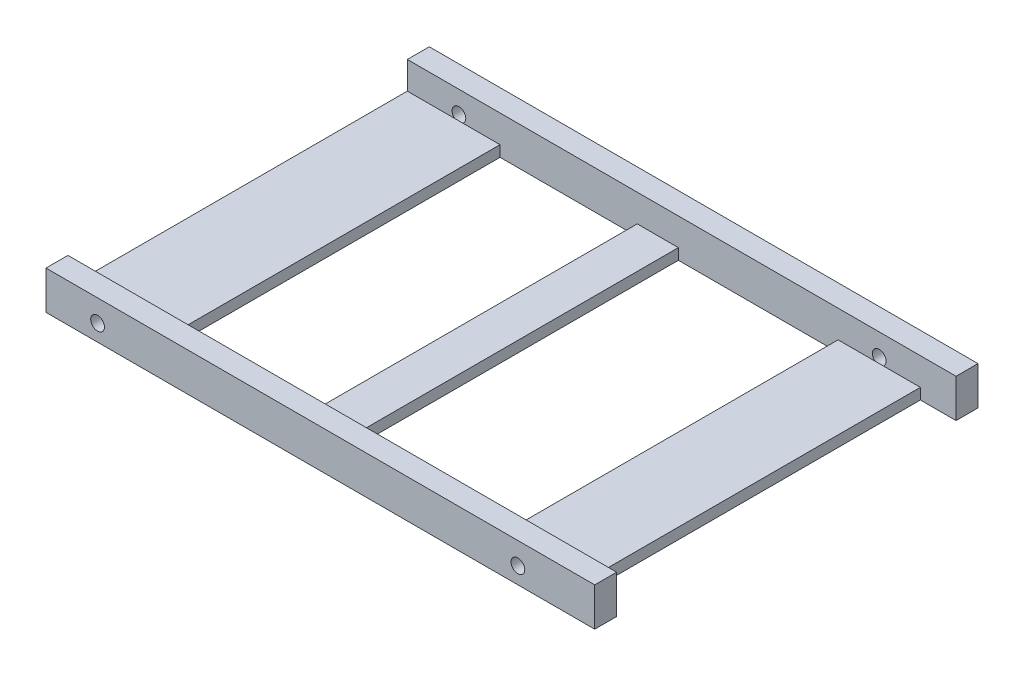
ISO-10303-21;
HEADER;
FILE_DESCRIPTION(('STEP AP214'),'2;1');
FILE_NAME('part.step','',(''),(''),'','','');
FILE_SCHEMA(('AUTOMOTIVE_DESIGN { 1 0 10303 214 1 1 1 1 }'));
ENDSEC;
DATA;
#1=APPLICATION_CONTEXT('core data for automotive mechanical design processes');
#2=APPLICATION_PROTOCOL_DEFINITION('international standard','automotive_design',2000,#1);
#3=PRODUCT_CONTEXT('',#1,'mechanical');
#4=PRODUCT('Part','Part','',(#3));
#5=PRODUCT_RELATED_PRODUCT_CATEGORY('part','',(#4));
#6=PRODUCT_DEFINITION_FORMATION('','',#4);
#7=PRODUCT_DEFINITION_CONTEXT('part definition',#1,'design');
#8=PRODUCT_DEFINITION('design','',#6,#7);
#9=PRODUCT_DEFINITION_SHAPE('','',#8);
#10=(LENGTH_UNIT() NAMED_UNIT(*) SI_UNIT(.MILLI.,.METRE.));
#11=(NAMED_UNIT(*) PLANE_ANGLE_UNIT() SI_UNIT($,.RADIAN.));
#12=(NAMED_UNIT(*) SI_UNIT($,.STERADIAN.) SOLID_ANGLE_UNIT());
#13=UNCERTAINTY_MEASURE_WITH_UNIT(LENGTH_MEASURE(1.E-05),#10,'distance_accuracy_value','');
#14=(GEOMETRIC_REPRESENTATION_CONTEXT(3) GLOBAL_UNCERTAINTY_ASSIGNED_CONTEXT((#13)) GLOBAL_UNIT_ASSIGNED_CONTEXT((#10,
#11,#12)) REPRESENTATION_CONTEXT('',''));
#15=CARTESIAN_POINT('',(0.,0.,0.));
#16=DIRECTION('',(0.,0.,1.));
#17=DIRECTION('',(1.,0.,0.));
#18=AXIS2_PLACEMENT_3D('',#15,#16,#17);
#19=CARTESIAN_POINT('',(0.,7.,0.));
#20=DIRECTION('',(0.,-1.,0.));
#21=DIRECTION('',(0.,0.,-1.));
#22=AXIS2_PLACEMENT_3D('',#19,#20,#21);
#23=PLANE('',#22);
#24=DIRECTION('',(0.,0.,1.));
#25=VECTOR('',#24,1.);
#26=CARTESIAN_POINT('',(0.,7.,0.));
#27=LINE('',#26,#25);
#28=CARTESIAN_POINT('',(0.,7.,-69.85));
#29=VERTEX_POINT('',#28);
#30=CARTESIAN_POINT('',(0.,7.,-65.85));
#31=VERTEX_POINT('',#30);
#32=EDGE_CURVE('E330',#29,#31,#27,.T.);
#33=ORIENTED_EDGE('',*,*,#32,.T.);
#34=DIRECTION('',(-1.,0.,0.));
#35=VECTOR('',#34,1.);
#36=CARTESIAN_POINT('',(16.9,7.,-65.85));
#37=LINE('',#36,#35);
#38=CARTESIAN_POINT('',(100.,7.,-65.85));
#39=VERTEX_POINT('',#38);
#40=EDGE_CURVE('E433',#39,#31,#37,.T.);
#41=ORIENTED_EDGE('',*,*,#40,.F.);
#42=DIRECTION('',(0.,0.,-1.));
#43=VECTOR('',#42,1.);
#44=CARTESIAN_POINT('',(100.,7.,0.));
#45=LINE('',#44,#43);
#46=CARTESIAN_POINT('',(100.,7.,-69.85));
#47=VERTEX_POINT('',#46);
#48=EDGE_CURVE('E338',#39,#47,#45,.T.);
#49=ORIENTED_EDGE('',*,*,#48,.T.);
#50=DIRECTION('',(-1.,0.,0.));
#51=VECTOR('',#50,1.);
#52=CARTESIAN_POINT('',(0.,7.,-69.85));
#53=LINE('',#52,#51);
#54=EDGE_CURVE('E343',#47,#29,#53,.T.);
#55=ORIENTED_EDGE('',*,*,#54,.T.);
#56=EDGE_LOOP('',(#33,#41,#49,#55));
#57=FACE_BOUND('',#56,.T.);
#58=ADVANCED_FACE('F43',(#57),#23,.F.);
#59=CARTESIAN_POINT('',(100.,7.,0.));
#60=DIRECTION('',(-1.,0.,0.));
#61=DIRECTION('',(0.,0.,1.));
#62=AXIS2_PLACEMENT_3D('',#59,#60,#61);
#63=PLANE('',#62);
#64=DIRECTION('',(0.,0.,-1.));
#65=VECTOR('',#64,1.);
#66=CARTESIAN_POINT('',(100.,0.,0.));
#67=LINE('',#66,#65);
#68=CARTESIAN_POINT('',(100.,0.,0.));
#69=VERTEX_POINT('',#68);
#70=CARTESIAN_POINT('',(100.,0.,-4.00000000000001));
#71=VERTEX_POINT('',#70);
#72=EDGE_CURVE('E354',#69,#71,#67,.T.);
#73=ORIENTED_EDGE('',*,*,#72,.T.);
#74=DIRECTION('',(0.,1.,0.));
#75=VECTOR('',#74,1.);
#76=CARTESIAN_POINT('',(100.,0.,-4.00000000000001));
#77=LINE('',#76,#75);
#78=CARTESIAN_POINT('',(100.,7.,-4.00000000000001));
#79=VERTEX_POINT('',#78);
#80=EDGE_CURVE('E300',#71,#79,#77,.T.);
#81=ORIENTED_EDGE('',*,*,#80,.T.);
#82=CARTESIAN_POINT('',(100.,7.,0.));
#83=VERTEX_POINT('',#82);
#84=EDGE_CURVE('E339',#83,#79,#45,.T.);
#85=ORIENTED_EDGE('',*,*,#84,.F.);
#86=DIRECTION('',(0.,-1.,0.));
#87=VECTOR('',#86,1.);
#88=CARTESIAN_POINT('',(100.,7.,0.));
#89=LINE('',#88,#87);
#90=EDGE_CURVE('E52',#83,#69,#89,.T.);
#91=ORIENTED_EDGE('',*,*,#90,.T.);
#92=EDGE_LOOP('',(#73,#81,#85,#91));
#93=FACE_BOUND('',#92,.T.);
#94=ADVANCED_FACE('F373',(#93),#63,.F.);
#95=CARTESIAN_POINT('',(0.,7.,0.));
#96=DIRECTION('',(1.,0.,0.));
#97=DIRECTION('',(0.,0.,-1.));
#98=AXIS2_PLACEMENT_3D('',#95,#96,#97);
#99=PLANE('',#98);
#100=DIRECTION('',(0.,0.,-1.));
#101=VECTOR('',#100,1.);
#102=CARTESIAN_POINT('',(0.,2.,-65.85));
#103=LINE('',#102,#101);
#104=CARTESIAN_POINT('',(0.,1.99999999999999,-3.99999999999998));
#105=VERTEX_POINT('',#104);
#106=CARTESIAN_POINT('',(0.,2.,-65.85));
#107=VERTEX_POINT('',#106);
#108=EDGE_CURVE('E474',#105,#107,#103,.T.);
#109=ORIENTED_EDGE('',*,*,#108,.T.);
#110=DIRECTION('',(0.,1.,0.));
#111=VECTOR('',#110,1.);
#112=CARTESIAN_POINT('',(0.,7.,-65.85));
#113=LINE('',#112,#111);
#114=EDGE_CURVE('E481',#107,#31,#113,.T.);
#115=ORIENTED_EDGE('',*,*,#114,.T.);
#116=ORIENTED_EDGE('',*,*,#32,.F.);
#117=DIRECTION('',(0.,-1.,0.));
#118=VECTOR('',#117,1.);
#119=CARTESIAN_POINT('',(0.,7.,-69.85));
#120=LINE('',#119,#118);
#121=CARTESIAN_POINT('',(0.,0.,-69.85));
#122=VERTEX_POINT('',#121);
#123=EDGE_CURVE('E346',#29,#122,#120,.T.);
#124=ORIENTED_EDGE('',*,*,#123,.T.);
#125=DIRECTION('',(0.,0.,1.));
#126=VECTOR('',#125,1.);
#127=CARTESIAN_POINT('',(0.,0.,0.));
#128=LINE('',#127,#126);
#129=CARTESIAN_POINT('',(0.,0.,0.));
#130=VERTEX_POINT('',#129);
#131=EDGE_CURVE('E315',#122,#130,#128,.T.);
#132=ORIENTED_EDGE('',*,*,#131,.T.);
#133=DIRECTION('',(0.,-1.,0.));
#134=VECTOR('',#133,1.);
#135=CARTESIAN_POINT('',(0.,7.,0.));
#136=LINE('',#135,#134);
#137=CARTESIAN_POINT('',(0.,7.,0.));
#138=VERTEX_POINT('',#137);
#139=EDGE_CURVE('E11',#138,#130,#136,.T.);
#140=ORIENTED_EDGE('',*,*,#139,.F.);
#141=CARTESIAN_POINT('',(0.,7.,-3.99999999999998));
#142=VERTEX_POINT('',#141);
#143=EDGE_CURVE('E335',#142,#138,#27,.T.);
#144=ORIENTED_EDGE('',*,*,#143,.F.);
#145=DIRECTION('',(0.,-1.,0.));
#146=VECTOR('',#145,1.);
#147=CARTESIAN_POINT('',(0.,7.,-3.99999999999998));
#148=LINE('',#147,#146);
#149=EDGE_CURVE('E476',#142,#105,#148,.T.);
#150=ORIENTED_EDGE('',*,*,#149,.T.);
#151=EDGE_LOOP('',(#109,#115,#116,#124,#132,#140,#144,#150));
#152=FACE_BOUND('',#151,.T.);
#153=ADVANCED_FACE('F45',(#152),#99,.F.);
#154=CARTESIAN_POINT('',(0.,7.,0.));
#155=DIRECTION('',(0.,0.,-1.));
#156=DIRECTION('',(-1.,0.,0.));
#157=AXIS2_PLACEMENT_3D('',#154,#155,#156);
#158=PLANE('',#157);
#159=CARTESIAN_POINT('',(9.40000000000001,3.,0.));
#160=DIRECTION('',(0.,0.,1.));
#161=DIRECTION('',(1.,0.,0.));
#162=AXIS2_PLACEMENT_3D('',#159,#160,#161);
#163=CIRCLE('',#162,1.25);
#164=CARTESIAN_POINT('',(10.65,3.,0.));
#165=VERTEX_POINT('',#164);
#166=EDGE_CURVE('E316',#165,#165,#163,.T.);
#167=ORIENTED_EDGE('',*,*,#166,.F.);
#168=EDGE_LOOP('',(#167));
#169=FACE_BOUND('',#168,.T.);
#170=CARTESIAN_POINT('',(86.,3.,0.));
#171=DIRECTION('',(0.,0.,1.));
#172=DIRECTION('',(1.,0.,0.));
#173=AXIS2_PLACEMENT_3D('',#170,#171,#172);
#174=CIRCLE('',#173,1.25);
#175=CARTESIAN_POINT('',(87.25,3.,0.));
#176=VERTEX_POINT('',#175);
#177=EDGE_CURVE('E321',#176,#176,#174,.T.);
#178=ORIENTED_EDGE('',*,*,#177,.F.);
#179=EDGE_LOOP('',(#178));
#180=FACE_BOUND('',#179,.T.);
#181=DIRECTION('',(1.,0.,0.));
#182=VECTOR('',#181,1.);
#183=CARTESIAN_POINT('',(0.,0.,0.));
#184=LINE('',#183,#182);
#185=EDGE_CURVE('E350',#130,#69,#184,.T.);
#186=ORIENTED_EDGE('',*,*,#185,.T.);
#187=ORIENTED_EDGE('',*,*,#90,.F.);
#188=DIRECTION('',(1.,0.,0.));
#189=VECTOR('',#188,1.);
#190=CARTESIAN_POINT('',(0.,7.,0.));
#191=LINE('',#190,#189);
#192=EDGE_CURVE('E334',#138,#83,#191,.T.);
#193=ORIENTED_EDGE('',*,*,#192,.F.);
#194=ORIENTED_EDGE('',*,*,#139,.T.);
#195=EDGE_LOOP('',(#186,#187,#193,#194));
#196=FACE_BOUND('',#195,.T.);
#197=ADVANCED_FACE('F388',(#169,#180,#196),#158,.F.);
#198=ORIENTED_EDGE('',*,*,#48,.F.);
#199=DIRECTION('',(0.,1.,0.));
#200=VECTOR('',#199,1.);
#201=CARTESIAN_POINT('',(100.,0.,-65.85));
#202=LINE('',#201,#200);
#203=CARTESIAN_POINT('',(100.,0.,-65.85));
#204=VERTEX_POINT('',#203);
#205=EDGE_CURVE('E288',#204,#39,#202,.T.);
#206=ORIENTED_EDGE('',*,*,#205,.F.);
#207=CARTESIAN_POINT('',(100.,0.,-69.85));
#208=VERTEX_POINT('',#207);
#209=EDGE_CURVE('E353',#204,#208,#67,.T.);
#210=ORIENTED_EDGE('',*,*,#209,.T.);
#211=DIRECTION('',(0.,-1.,0.));
#212=VECTOR('',#211,1.);
#213=CARTESIAN_POINT('',(100.,7.,-69.85));
#214=LINE('',#213,#212);
#215=EDGE_CURVE('E364',#47,#208,#214,.T.);
#216=ORIENTED_EDGE('',*,*,#215,.F.);
#217=EDGE_LOOP('',(#198,#206,#210,#216));
#218=FACE_BOUND('',#217,.T.);
#219=ADVANCED_FACE('F402',(#218),#63,.F.);
#220=CARTESIAN_POINT('',(0.,7.,-69.85));
#221=DIRECTION('',(0.,0.,1.));
#222=DIRECTION('',(1.,0.,0.));
#223=AXIS2_PLACEMENT_3D('',#220,#221,#222);
#224=PLANE('',#223);
#225=CARTESIAN_POINT('',(9.40000000000001,3.,-69.85));
#226=DIRECTION('',(0.,0.,1.));
#227=DIRECTION('',(1.,0.,0.));
#228=AXIS2_PLACEMENT_3D('',#225,#226,#227);
#229=CIRCLE('',#228,1.25);
#230=CARTESIAN_POINT('',(10.65,3.,-69.85));
#231=VERTEX_POINT('',#230);
#232=EDGE_CURVE('E206',#231,#231,#229,.T.);
#233=ORIENTED_EDGE('',*,*,#232,.T.);
#234=EDGE_LOOP('',(#233));
#235=FACE_BOUND('',#234,.T.);
#236=CARTESIAN_POINT('',(86.,3.,-69.85));
#237=DIRECTION('',(0.,0.,1.));
#238=DIRECTION('',(1.,0.,0.));
#239=AXIS2_PLACEMENT_3D('',#236,#237,#238);
#240=CIRCLE('',#239,1.25);
#241=CARTESIAN_POINT('',(87.25,3.,-69.85));
#242=VERTEX_POINT('',#241);
#243=EDGE_CURVE('E215',#242,#242,#240,.T.);
#244=ORIENTED_EDGE('',*,*,#243,.T.);
#245=EDGE_LOOP('',(#244));
#246=FACE_BOUND('',#245,.T.);
#247=DIRECTION('',(-1.,0.,0.));
#248=VECTOR('',#247,1.);
#249=CARTESIAN_POINT('',(0.,0.,-69.85));
#250=LINE('',#249,#248);
#251=EDGE_CURVE('E358',#208,#122,#250,.T.);
#252=ORIENTED_EDGE('',*,*,#251,.T.);
#253=ORIENTED_EDGE('',*,*,#123,.F.);
#254=ORIENTED_EDGE('',*,*,#54,.F.);
#255=ORIENTED_EDGE('',*,*,#215,.T.);
#256=EDGE_LOOP('',(#252,#253,#254,#255));
#257=FACE_BOUND('',#256,.T.);
#258=ADVANCED_FACE('F397',(#235,#246,#257),#224,.F.);
#259=ORIENTED_EDGE('',*,*,#84,.T.);
#260=DIRECTION('',(1.,0.,0.));
#261=VECTOR('',#260,1.);
#262=CARTESIAN_POINT('',(16.9,7.,-3.99999999999999));
#263=LINE('',#262,#261);
#264=EDGE_CURVE('E287',#142,#79,#263,.T.);
#265=ORIENTED_EDGE('',*,*,#264,.F.);
#266=ORIENTED_EDGE('',*,*,#143,.T.);
#267=ORIENTED_EDGE('',*,*,#192,.T.);
#268=EDGE_LOOP('',(#259,#265,#266,#267));
#269=FACE_BOUND('',#268,.T.);
#270=ADVANCED_FACE('F385',(#269),#23,.F.);
#271=CARTESIAN_POINT('',(0.,0.,0.));
#272=DIRECTION('',(0.,-1.,0.));
#273=DIRECTION('',(0.,0.,-1.));
#274=AXIS2_PLACEMENT_3D('',#271,#272,#273);
#275=PLANE('',#274);
#276=DIRECTION('',(0.,0.,1.));
#277=VECTOR('',#276,1.);
#278=CARTESIAN_POINT('',(16.9,0.,-65.85));
#279=LINE('',#278,#277);
#280=CARTESIAN_POINT('',(16.9,0.,-65.85));
#281=VERTEX_POINT('',#280);
#282=CARTESIAN_POINT('',(16.9,0.,-3.99999999999999));
#283=VERTEX_POINT('',#282);
#284=EDGE_CURVE('E429',#281,#283,#279,.T.);
#285=ORIENTED_EDGE('',*,*,#284,.T.);
#286=DIRECTION('',(1.,0.,0.));
#287=VECTOR('',#286,1.);
#288=CARTESIAN_POINT('',(16.9,0.,-3.99999999999999));
#289=LINE('',#288,#287);
#290=CARTESIAN_POINT('',(41.9,0.,-3.99999999999999));
#291=VERTEX_POINT('',#290);
#292=EDGE_CURVE('E425',#283,#291,#289,.T.);
#293=ORIENTED_EDGE('',*,*,#292,.T.);
#294=DIRECTION('',(0.,0.,-1.));
#295=VECTOR('',#294,1.);
#296=CARTESIAN_POINT('',(41.9,0.,-65.85));
#297=LINE('',#296,#295);
#298=CARTESIAN_POINT('',(41.9,0.,-65.85));
#299=VERTEX_POINT('',#298);
#300=EDGE_CURVE('E421',#291,#299,#297,.T.);
#301=ORIENTED_EDGE('',*,*,#300,.T.);
#302=DIRECTION('',(-1.,0.,0.));
#303=VECTOR('',#302,1.);
#304=CARTESIAN_POINT('',(16.9,0.,-65.85));
#305=LINE('',#304,#303);
#306=EDGE_CURVE('E417',#299,#281,#305,.T.);
#307=ORIENTED_EDGE('',*,*,#306,.T.);
#308=EDGE_LOOP('',(#285,#293,#301,#307));
#309=FACE_BOUND('',#308,.T.);
#310=DIRECTION('',(0.,0.,1.));
#311=VECTOR('',#310,1.);
#312=CARTESIAN_POINT('',(49.4,0.,-65.85));
#313=LINE('',#312,#311);
#314=CARTESIAN_POINT('',(49.4,0.,-65.85));
#315=VERTEX_POINT('',#314);
#316=CARTESIAN_POINT('',(49.4,0.,-3.99999999999999));
#317=VERTEX_POINT('',#316);
#318=EDGE_CURVE('E258',#315,#317,#313,.T.);
#319=ORIENTED_EDGE('',*,*,#318,.T.);
#320=DIRECTION('',(1.,0.,0.));
#321=VECTOR('',#320,1.);
#322=CARTESIAN_POINT('',(49.4,0.,-3.99999999999999));
#323=LINE('',#322,#321);
#324=CARTESIAN_POINT('',(78.5,0.,-3.99999999999999));
#325=VERTEX_POINT('',#324);
#326=EDGE_CURVE('E281',#317,#325,#323,.T.);
#327=ORIENTED_EDGE('',*,*,#326,.T.);
#328=DIRECTION('',(0.,0.,-1.));
#329=VECTOR('',#328,1.);
#330=CARTESIAN_POINT('',(78.5,0.,-65.85));
#331=LINE('',#330,#329);
#332=CARTESIAN_POINT('',(78.5,0.,-65.85));
#333=VERTEX_POINT('',#332);
#334=EDGE_CURVE('E276',#325,#333,#331,.T.);
#335=ORIENTED_EDGE('',*,*,#334,.T.);
#336=DIRECTION('',(-1.,0.,0.));
#337=VECTOR('',#336,1.);
#338=CARTESIAN_POINT('',(49.4,0.,-65.85));
#339=LINE('',#338,#337);
#340=EDGE_CURVE('E273',#333,#315,#339,.T.);
#341=ORIENTED_EDGE('',*,*,#340,.T.);
#342=EDGE_LOOP('',(#319,#327,#335,#341));
#343=FACE_BOUND('',#342,.T.);
#344=DIRECTION('',(1.,0.,0.));
#345=VECTOR('',#344,1.);
#346=CARTESIAN_POINT('',(100.,0.,-4.00000000000001));
#347=LINE('',#346,#345);
#348=CARTESIAN_POINT('',(93.5,0.,-4.));
#349=VERTEX_POINT('',#348);
#350=EDGE_CURVE('E292',#349,#71,#347,.T.);
#351=ORIENTED_EDGE('',*,*,#350,.T.);
#352=ORIENTED_EDGE('',*,*,#72,.F.);
#353=ORIENTED_EDGE('',*,*,#185,.F.);
#354=ORIENTED_EDGE('',*,*,#131,.F.);
#355=ORIENTED_EDGE('',*,*,#251,.F.);
#356=ORIENTED_EDGE('',*,*,#209,.F.);
#357=DIRECTION('',(-1.,0.,0.));
#358=VECTOR('',#357,1.);
#359=CARTESIAN_POINT('',(100.,0.,-65.85));
#360=LINE('',#359,#358);
#361=CARTESIAN_POINT('',(93.5,0.,-65.85));
#362=VERTEX_POINT('',#361);
#363=EDGE_CURVE('E262',#204,#362,#360,.T.);
#364=ORIENTED_EDGE('',*,*,#363,.T.);
#365=DIRECTION('',(0.,0.,1.));
#366=VECTOR('',#365,1.);
#367=CARTESIAN_POINT('',(93.5,0.,-65.85));
#368=LINE('',#367,#366);
#369=EDGE_CURVE('E269',#362,#349,#368,.T.);
#370=ORIENTED_EDGE('',*,*,#369,.T.);
#371=EDGE_LOOP('',(#351,#352,#353,#354,#355,#356,#364,#370));
#372=FACE_BOUND('',#371,.T.);
#373=ADVANCED_FACE('F377',(#309,#343,#372),#275,.T.);
#374=CARTESIAN_POINT('',(86.,3.,-4.));
#375=DIRECTION('',(0.,0.,1.));
#376=DIRECTION('',(1.,0.,0.));
#377=AXIS2_PLACEMENT_3D('',#374,#375,#376);
#378=CYLINDRICAL_SURFACE('',#377,1.25);
#379=CARTESIAN_POINT('',(86.,3.,-4.));
#380=DIRECTION('',(0.,0.,1.));
#381=DIRECTION('',(1.,0.,0.));
#382=AXIS2_PLACEMENT_3D('',#379,#380,#381);
#383=CIRCLE('',#382,1.25);
#384=CARTESIAN_POINT('',(85.25,1.99999999999999,-4.));
#385=VERTEX_POINT('',#384);
#386=CARTESIAN_POINT('',(86.75,1.99999999999999,-4.));
#387=VERTEX_POINT('',#386);
#388=EDGE_CURVE('E325',#385,#387,#383,.T.);
#389=ORIENTED_EDGE('',*,*,#388,.F.);
#390=EDGE_CURVE('E304',#387,#385,#383,.T.);
#391=ORIENTED_EDGE('',*,*,#390,.F.);
#392=EDGE_LOOP('',(#389,#391));
#393=FACE_BOUND('',#392,.T.);
#394=ORIENTED_EDGE('',*,*,#177,.T.);
#395=EDGE_LOOP('',(#394));
#396=FACE_BOUND('',#395,.T.);
#397=ADVANCED_FACE('F524',(#393,#396),#378,.F.);
#398=CARTESIAN_POINT('',(86.,3.,-4.));
#399=DIRECTION('',(0.,0.,1.));
#400=DIRECTION('',(1.,0.,0.));
#401=AXIS2_PLACEMENT_3D('',#398,#399,#400);
#402=PLANE('',#401);
#403=DIRECTION('',(1.,0.,0.));
#404=VECTOR('',#403,1.);
#405=CARTESIAN_POINT('',(0.,1.99999999999999,-3.99999999999998));
#406=LINE('',#405,#404);
#407=EDGE_CURVE('E466',#385,#387,#406,.T.);
#408=ORIENTED_EDGE('',*,*,#407,.F.);
#409=ORIENTED_EDGE('',*,*,#388,.T.);
#410=EDGE_LOOP('',(#408,#409));
#411=FACE_BOUND('',#410,.T.);
#412=ADVANCED_FACE('F541',(#411),#402,.T.);
#413=CARTESIAN_POINT('',(9.40000000000001,3.,-4.));
#414=DIRECTION('',(0.,0.,1.));
#415=DIRECTION('',(1.,0.,0.));
#416=AXIS2_PLACEMENT_3D('',#413,#414,#415);
#417=CYLINDRICAL_SURFACE('',#416,1.25);
#418=CARTESIAN_POINT('',(9.40000000000001,3.,-4.));
#419=DIRECTION('',(0.,0.,1.));
#420=DIRECTION('',(1.,0.,0.));
#421=AXIS2_PLACEMENT_3D('',#418,#419,#420);
#422=CIRCLE('',#421,1.25);
#423=CARTESIAN_POINT('',(8.65000000000002,1.99999999999999,-4.));
#424=VERTEX_POINT('',#423);
#425=CARTESIAN_POINT('',(10.15,1.99999999999999,-3.99999999999999));
#426=VERTEX_POINT('',#425);
#427=EDGE_CURVE('E311',#424,#426,#422,.T.);
#428=ORIENTED_EDGE('',*,*,#427,.F.);
#429=EDGE_CURVE('E317',#426,#424,#422,.T.);
#430=ORIENTED_EDGE('',*,*,#429,.F.);
#431=EDGE_LOOP('',(#428,#430));
#432=FACE_BOUND('',#431,.T.);
#433=ORIENTED_EDGE('',*,*,#166,.T.);
#434=EDGE_LOOP('',(#433));
#435=FACE_BOUND('',#434,.T.);
#436=ADVANCED_FACE('F547',(#432,#435),#417,.F.);
#437=CARTESIAN_POINT('',(9.40000000000001,3.,-4.));
#438=DIRECTION('',(0.,0.,1.));
#439=DIRECTION('',(1.,0.,0.));
#440=AXIS2_PLACEMENT_3D('',#437,#438,#439);
#441=PLANE('',#440);
#442=EDGE_CURVE('E224',#424,#426,#406,.T.);
#443=ORIENTED_EDGE('',*,*,#442,.F.);
#444=ORIENTED_EDGE('',*,*,#427,.T.);
#445=EDGE_LOOP('',(#443,#444));
#446=FACE_BOUND('',#445,.T.);
#447=ADVANCED_FACE('F553',(#446),#441,.T.);
#448=CARTESIAN_POINT('',(93.5,0.,-65.85));
#449=DIRECTION('',(-1.,0.,0.));
#450=DIRECTION('',(0.,0.,1.));
#451=AXIS2_PLACEMENT_3D('',#448,#449,#450);
#452=PLANE('',#451);
#453=DIRECTION('',(0.,1.,0.));
#454=VECTOR('',#453,1.);
#455=CARTESIAN_POINT('',(93.5,0.,-65.85));
#456=LINE('',#455,#454);
#457=CARTESIAN_POINT('',(93.5,2.,-65.85));
#458=VERTEX_POINT('',#457);
#459=EDGE_CURVE('E293',#362,#458,#456,.T.);
#460=ORIENTED_EDGE('',*,*,#459,.T.);
#461=DIRECTION('',(0.,0.,-1.));
#462=VECTOR('',#461,1.);
#463=CARTESIAN_POINT('',(93.5,2.,-65.85));
#464=LINE('',#463,#462);
#465=CARTESIAN_POINT('',(93.5,1.99999999999999,-4.));
#466=VERTEX_POINT('',#465);
#467=EDGE_CURVE('E218',#466,#458,#464,.T.);
#468=ORIENTED_EDGE('',*,*,#467,.F.);
#469=DIRECTION('',(0.,1.,0.));
#470=VECTOR('',#469,1.);
#471=CARTESIAN_POINT('',(93.5,0.,-4.));
#472=LINE('',#471,#470);
#473=EDGE_CURVE('E296',#349,#466,#472,.T.);
#474=ORIENTED_EDGE('',*,*,#473,.F.);
#475=ORIENTED_EDGE('',*,*,#369,.F.);
#476=EDGE_LOOP('',(#460,#468,#474,#475));
#477=FACE_BOUND('',#476,.T.);
#478=ADVANCED_FACE('F557',(#477),#452,.F.);
#479=CARTESIAN_POINT('',(49.4,0.,-65.85));
#480=DIRECTION('',(-1.,0.,0.));
#481=DIRECTION('',(0.,0.,1.));
#482=AXIS2_PLACEMENT_3D('',#479,#480,#481);
#483=PLANE('',#482);
#484=DIRECTION('',(0.,1.,0.));
#485=VECTOR('',#484,1.);
#486=CARTESIAN_POINT('',(49.4,0.,-65.85));
#487=LINE('',#486,#485);
#488=CARTESIAN_POINT('',(49.4,2.,-65.85));
#489=VERTEX_POINT('',#488);
#490=EDGE_CURVE('E245',#315,#489,#487,.T.);
#491=ORIENTED_EDGE('',*,*,#490,.T.);
#492=DIRECTION('',(0.,0.,1.));
#493=VECTOR('',#492,1.);
#494=CARTESIAN_POINT('',(49.4,2.,-65.85));
#495=LINE('',#494,#493);
#496=CARTESIAN_POINT('',(49.4,1.99999999999999,-3.99999999999999));
#497=VERTEX_POINT('',#496);
#498=EDGE_CURVE('E255',#489,#497,#495,.T.);
#499=ORIENTED_EDGE('',*,*,#498,.T.);
#500=DIRECTION('',(0.,1.,0.));
#501=VECTOR('',#500,1.);
#502=CARTESIAN_POINT('',(49.4,0.,-3.99999999999999));
#503=LINE('',#502,#501);
#504=EDGE_CURVE('E277',#317,#497,#503,.T.);
#505=ORIENTED_EDGE('',*,*,#504,.F.);
#506=ORIENTED_EDGE('',*,*,#318,.F.);
#507=EDGE_LOOP('',(#491,#499,#505,#506));
#508=FACE_BOUND('',#507,.T.);
#509=ADVANCED_FACE('F254',(#508),#483,.F.);
#510=CARTESIAN_POINT('',(78.5,0.,-65.85));
#511=DIRECTION('',(1.,0.,0.));
#512=DIRECTION('',(0.,0.,-1.));
#513=AXIS2_PLACEMENT_3D('',#510,#511,#512);
#514=PLANE('',#513);
#515=DIRECTION('',(0.,1.,0.));
#516=VECTOR('',#515,1.);
#517=CARTESIAN_POINT('',(78.5,0.,-3.99999999999999));
#518=LINE('',#517,#516);
#519=CARTESIAN_POINT('',(78.5,1.99999999999999,-3.99999999999999));
#520=VERTEX_POINT('',#519);
#521=EDGE_CURVE('E266',#325,#520,#518,.T.);
#522=ORIENTED_EDGE('',*,*,#521,.T.);
#523=DIRECTION('',(0.,0.,-1.));
#524=VECTOR('',#523,1.);
#525=CARTESIAN_POINT('',(78.5,2.,-65.85));
#526=LINE('',#525,#524);
#527=CARTESIAN_POINT('',(78.5,2.,-65.85));
#528=VERTEX_POINT('',#527);
#529=EDGE_CURVE('E448',#520,#528,#526,.T.);
#530=ORIENTED_EDGE('',*,*,#529,.T.);
#531=DIRECTION('',(0.,1.,0.));
#532=VECTOR('',#531,1.);
#533=CARTESIAN_POINT('',(78.5,0.,-65.85));
#534=LINE('',#533,#532);
#535=EDGE_CURVE('E261',#333,#528,#534,.T.);
#536=ORIENTED_EDGE('',*,*,#535,.F.);
#537=ORIENTED_EDGE('',*,*,#334,.F.);
#538=EDGE_LOOP('',(#522,#530,#536,#537));
#539=FACE_BOUND('',#538,.T.);
#540=ADVANCED_FACE('F562',(#539),#514,.F.);
#541=CARTESIAN_POINT('',(16.9,0.,-65.85));
#542=DIRECTION('',(-1.,0.,0.));
#543=DIRECTION('',(0.,0.,1.));
#544=AXIS2_PLACEMENT_3D('',#541,#542,#543);
#545=PLANE('',#544);
#546=DIRECTION('',(0.,1.,0.));
#547=VECTOR('',#546,1.);
#548=CARTESIAN_POINT('',(16.9,0.,-65.85));
#549=LINE('',#548,#547);
#550=CARTESIAN_POINT('',(16.9,2.,-65.85));
#551=VERTEX_POINT('',#550);
#552=EDGE_CURVE('E329',#281,#551,#549,.T.);
#553=ORIENTED_EDGE('',*,*,#552,.T.);
#554=DIRECTION('',(0.,0.,1.));
#555=VECTOR('',#554,1.);
#556=CARTESIAN_POINT('',(16.9,2.,-65.85));
#557=LINE('',#556,#555);
#558=CARTESIAN_POINT('',(16.9,1.99999999999999,-3.99999999999999));
#559=VERTEX_POINT('',#558);
#560=EDGE_CURVE('E451',#551,#559,#557,.T.);
#561=ORIENTED_EDGE('',*,*,#560,.T.);
#562=DIRECTION('',(0.,1.,0.));
#563=VECTOR('',#562,1.);
#564=CARTESIAN_POINT('',(16.9,0.,-3.99999999999999));
#565=LINE('',#564,#563);
#566=EDGE_CURVE('E414',#283,#559,#565,.T.);
#567=ORIENTED_EDGE('',*,*,#566,.F.);
#568=ORIENTED_EDGE('',*,*,#284,.F.);
#569=EDGE_LOOP('',(#553,#561,#567,#568));
#570=FACE_BOUND('',#569,.T.);
#571=ADVANCED_FACE('F565',(#570),#545,.F.);
#572=CARTESIAN_POINT('',(16.9,0.,-65.85));
#573=DIRECTION('',(0.,0.,-1.));
#574=DIRECTION('',(-1.,0.,0.));
#575=AXIS2_PLACEMENT_3D('',#572,#573,#574);
#576=PLANE('',#575);
#577=CARTESIAN_POINT('',(9.40000000000001,3.,-65.85));
#578=DIRECTION('',(0.,0.,1.));
#579=DIRECTION('',(1.,0.,0.));
#580=AXIS2_PLACEMENT_3D('',#577,#578,#579);
#581=CIRCLE('',#580,1.25);
#582=CARTESIAN_POINT('',(10.15,2.,-65.85));
#583=VERTEX_POINT('',#582);
#584=CARTESIAN_POINT('',(8.65000000000001,2.,-65.85));
#585=VERTEX_POINT('',#584);
#586=EDGE_CURVE('E487',#583,#585,#581,.T.);
#587=ORIENTED_EDGE('',*,*,#586,.F.);
#588=DIRECTION('',(1.,0.,0.));
#589=VECTOR('',#588,1.);
#590=CARTESIAN_POINT('',(0.,2.,-65.85));
#591=LINE('',#590,#589);
#592=EDGE_CURVE('E230',#583,#551,#591,.T.);
#593=ORIENTED_EDGE('',*,*,#592,.T.);
#594=ORIENTED_EDGE('',*,*,#552,.F.);
#595=ORIENTED_EDGE('',*,*,#306,.F.);
#596=DIRECTION('',(0.,1.,0.));
#597=VECTOR('',#596,1.);
#598=CARTESIAN_POINT('',(41.9,0.,-65.85));
#599=LINE('',#598,#597);
#600=CARTESIAN_POINT('',(41.9,2.,-65.85));
#601=VERTEX_POINT('',#600);
#602=EDGE_CURVE('E248',#299,#601,#599,.T.);
#603=ORIENTED_EDGE('',*,*,#602,.T.);
#604=EDGE_CURVE('E236',#601,#489,#591,.T.);
#605=ORIENTED_EDGE('',*,*,#604,.T.);
#606=ORIENTED_EDGE('',*,*,#490,.F.);
#607=ORIENTED_EDGE('',*,*,#340,.F.);
#608=ORIENTED_EDGE('',*,*,#535,.T.);
#609=CARTESIAN_POINT('',(85.25,2.,-65.85));
#610=VERTEX_POINT('',#609);
#611=EDGE_CURVE('E197',#528,#610,#591,.T.);
#612=ORIENTED_EDGE('',*,*,#611,.T.);
#613=CARTESIAN_POINT('',(86.,3.,-65.85));
#614=DIRECTION('',(0.,0.,1.));
#615=DIRECTION('',(1.,0.,0.));
#616=AXIS2_PLACEMENT_3D('',#613,#614,#615);
#617=CIRCLE('',#616,1.25);
#618=CARTESIAN_POINT('',(86.75,2.,-65.85));
#619=VERTEX_POINT('',#618);
#620=EDGE_CURVE('E204',#619,#610,#617,.T.);
#621=ORIENTED_EDGE('',*,*,#620,.F.);
#622=EDGE_CURVE('E198',#619,#458,#591,.T.);
#623=ORIENTED_EDGE('',*,*,#622,.T.);
#624=ORIENTED_EDGE('',*,*,#459,.F.);
#625=ORIENTED_EDGE('',*,*,#363,.F.);
#626=ORIENTED_EDGE('',*,*,#205,.T.);
#627=ORIENTED_EDGE('',*,*,#40,.T.);
#628=ORIENTED_EDGE('',*,*,#114,.F.);
#629=EDGE_CURVE('E227',#107,#585,#591,.T.);
#630=ORIENTED_EDGE('',*,*,#629,.T.);
#631=EDGE_LOOP('',(#587,#593,#594,#595,#603,#605,#606,#607,#608,#612,#621,#623,#624,#625,#626,
#627,#628,#630));
#632=FACE_BOUND('',#631,.T.);
#633=ADVANCED_FACE('F210',(#632),#576,.F.);
#634=CARTESIAN_POINT('',(41.9,0.,-65.85));
#635=DIRECTION('',(1.,0.,0.));
#636=DIRECTION('',(0.,0.,-1.));
#637=AXIS2_PLACEMENT_3D('',#634,#635,#636);
#638=PLANE('',#637);
#639=DIRECTION('',(0.,1.,0.));
#640=VECTOR('',#639,1.);
#641=CARTESIAN_POINT('',(41.9,0.,-3.99999999999999));
#642=LINE('',#641,#640);
#643=CARTESIAN_POINT('',(41.9,1.99999999999999,-3.99999999999999));
#644=VERTEX_POINT('',#643);
#645=EDGE_CURVE('E410',#291,#644,#642,.T.);
#646=ORIENTED_EDGE('',*,*,#645,.T.);
#647=DIRECTION('',(0.,0.,-1.));
#648=VECTOR('',#647,1.);
#649=CARTESIAN_POINT('',(41.9,2.,-65.85));
#650=LINE('',#649,#648);
#651=EDGE_CURVE('E235',#644,#601,#650,.T.);
#652=ORIENTED_EDGE('',*,*,#651,.T.);
#653=ORIENTED_EDGE('',*,*,#602,.F.);
#654=ORIENTED_EDGE('',*,*,#300,.F.);
#655=EDGE_LOOP('',(#646,#652,#653,#654));
#656=FACE_BOUND('',#655,.T.);
#657=ADVANCED_FACE('F457',(#656),#638,.F.);
#658=CARTESIAN_POINT('',(16.9,0.,-3.99999999999999));
#659=DIRECTION('',(0.,0.,1.));
#660=DIRECTION('',(1.,0.,0.));
#661=AXIS2_PLACEMENT_3D('',#658,#659,#660);
#662=PLANE('',#661);
#663=ORIENTED_EDGE('',*,*,#566,.T.);
#664=EDGE_CURVE('E462',#426,#559,#406,.T.);
#665=ORIENTED_EDGE('',*,*,#664,.F.);
#666=ORIENTED_EDGE('',*,*,#429,.T.);
#667=EDGE_CURVE('E221',#105,#424,#406,.T.);
#668=ORIENTED_EDGE('',*,*,#667,.F.);
#669=ORIENTED_EDGE('',*,*,#149,.F.);
#670=ORIENTED_EDGE('',*,*,#264,.T.);
#671=ORIENTED_EDGE('',*,*,#80,.F.);
#672=ORIENTED_EDGE('',*,*,#350,.F.);
#673=ORIENTED_EDGE('',*,*,#473,.T.);
#674=EDGE_CURVE('E226',#387,#466,#406,.T.);
#675=ORIENTED_EDGE('',*,*,#674,.F.);
#676=ORIENTED_EDGE('',*,*,#390,.T.);
#677=EDGE_CURVE('E463',#520,#385,#406,.T.);
#678=ORIENTED_EDGE('',*,*,#677,.F.);
#679=ORIENTED_EDGE('',*,*,#521,.F.);
#680=ORIENTED_EDGE('',*,*,#326,.F.);
#681=ORIENTED_EDGE('',*,*,#504,.T.);
#682=EDGE_CURVE('E460',#644,#497,#406,.T.);
#683=ORIENTED_EDGE('',*,*,#682,.F.);
#684=ORIENTED_EDGE('',*,*,#645,.F.);
#685=ORIENTED_EDGE('',*,*,#292,.F.);
#686=EDGE_LOOP('',(#663,#665,#666,#668,#669,#670,#671,#672,#673,#675,#676,#678,#679,#680,#681,
#683,#684,#685));
#687=FACE_BOUND('',#686,.T.);
#688=ADVANCED_FACE('F382',(#687),#662,.F.);
#689=CARTESIAN_POINT('',(0.,2.,-65.85));
#690=DIRECTION('',(0.,-1.,0.));
#691=DIRECTION('',(0.,0.,-1.));
#692=AXIS2_PLACEMENT_3D('',#689,#690,#691);
#693=PLANE('',#692);
#694=ORIENTED_EDGE('',*,*,#604,.F.);
#695=ORIENTED_EDGE('',*,*,#651,.F.);
#696=ORIENTED_EDGE('',*,*,#682,.T.);
#697=ORIENTED_EDGE('',*,*,#498,.F.);
#698=EDGE_LOOP('',(#694,#695,#696,#697));
#699=FACE_BOUND('',#698,.T.);
#700=ADVANCED_FACE('F459',(#699),#693,.F.);
#701=ORIENTED_EDGE('',*,*,#629,.F.);
#702=ORIENTED_EDGE('',*,*,#108,.F.);
#703=ORIENTED_EDGE('',*,*,#667,.T.);
#704=ORIENTED_EDGE('',*,*,#442,.T.);
#705=ORIENTED_EDGE('',*,*,#664,.T.);
#706=ORIENTED_EDGE('',*,*,#560,.F.);
#707=ORIENTED_EDGE('',*,*,#592,.F.);
#708=EDGE_CURVE('E222',#585,#583,#591,.T.);
#709=ORIENTED_EDGE('',*,*,#708,.F.);
#710=EDGE_LOOP('',(#701,#702,#703,#704,#705,#706,#707,#709));
#711=FACE_BOUND('',#710,.T.);
#712=ADVANCED_FACE('F577',(#711),#693,.F.);
#713=ORIENTED_EDGE('',*,*,#677,.T.);
#714=ORIENTED_EDGE('',*,*,#407,.T.);
#715=ORIENTED_EDGE('',*,*,#674,.T.);
#716=ORIENTED_EDGE('',*,*,#467,.T.);
#717=ORIENTED_EDGE('',*,*,#622,.F.);
#718=EDGE_CURVE('E191',#610,#619,#591,.T.);
#719=ORIENTED_EDGE('',*,*,#718,.F.);
#720=ORIENTED_EDGE('',*,*,#611,.F.);
#721=ORIENTED_EDGE('',*,*,#529,.F.);
#722=EDGE_LOOP('',(#713,#714,#715,#716,#717,#719,#720,#721));
#723=FACE_BOUND('',#722,.T.);
#724=ADVANCED_FACE('F216',(#723),#693,.F.);
#725=CARTESIAN_POINT('',(86.,3.,-65.85));
#726=DIRECTION('',(0.,0.,-1.));
#727=DIRECTION('',(1.,0.,0.));
#728=AXIS2_PLACEMENT_3D('',#725,#726,#727);
#729=PLANE('',#728);
#730=ORIENTED_EDGE('',*,*,#718,.T.);
#731=EDGE_CURVE('E65',#610,#619,#617,.T.);
#732=ORIENTED_EDGE('',*,*,#731,.F.);
#733=EDGE_LOOP('',(#730,#732));
#734=FACE_BOUND('',#733,.T.);
#735=ADVANCED_FACE('F192',(#734),#729,.T.);
#736=CARTESIAN_POINT('',(86.,3.,-65.85));
#737=DIRECTION('',(0.,0.,-1.));
#738=DIRECTION('',(-1.,0.,0.));
#739=AXIS2_PLACEMENT_3D('',#736,#737,#738);
#740=CYLINDRICAL_SURFACE('',#739,1.25);
#741=ORIENTED_EDGE('',*,*,#731,.T.);
#742=ORIENTED_EDGE('',*,*,#620,.T.);
#743=EDGE_LOOP('',(#741,#742));
#744=FACE_BOUND('',#743,.T.);
#745=ORIENTED_EDGE('',*,*,#243,.F.);
#746=EDGE_LOOP('',(#745));
#747=FACE_BOUND('',#746,.T.);
#748=ADVANCED_FACE('F202',(#744,#747),#740,.F.);
#749=CARTESIAN_POINT('',(9.40000000000001,3.,-65.85));
#750=DIRECTION('',(0.,0.,-1.));
#751=DIRECTION('',(1.,0.,0.));
#752=AXIS2_PLACEMENT_3D('',#749,#750,#751);
#753=PLANE('',#752);
#754=ORIENTED_EDGE('',*,*,#708,.T.);
#755=EDGE_CURVE('E58',#585,#583,#581,.T.);
#756=ORIENTED_EDGE('',*,*,#755,.F.);
#757=EDGE_LOOP('',(#754,#756));
#758=FACE_BOUND('',#757,.T.);
#759=ADVANCED_FACE('F500',(#758),#753,.T.);
#760=CARTESIAN_POINT('',(9.40000000000001,3.,-65.85));
#761=DIRECTION('',(0.,0.,-1.));
#762=DIRECTION('',(-1.,0.,0.));
#763=AXIS2_PLACEMENT_3D('',#760,#761,#762);
#764=CYLINDRICAL_SURFACE('',#763,1.25);
#765=ORIENTED_EDGE('',*,*,#755,.T.);
#766=ORIENTED_EDGE('',*,*,#586,.T.);
#767=EDGE_LOOP('',(#765,#766));
#768=FACE_BOUND('',#767,.T.);
#769=ORIENTED_EDGE('',*,*,#232,.F.);
#770=EDGE_LOOP('',(#769));
#771=FACE_BOUND('',#770,.T.);
#772=ADVANCED_FACE('F506',(#768,#771),#764,.F.);
#773=CLOSED_SHELL('',(#58,#94,#153,#197,#219,#258,#270,#373,#397,#412,#436,#447,#478,#509,#540,
#571,#633,#657,#688,#700,#712,#724,#735,#748,#759,#772));
#774=MANIFOLD_SOLID_BREP('B2',#773);
#775=ADVANCED_BREP_SHAPE_REPRESENTATION('',(#18,#774),#14);
#776=SHAPE_DEFINITION_REPRESENTATION(#9,#775);
ENDSEC;
END-ISO-10303-21;
